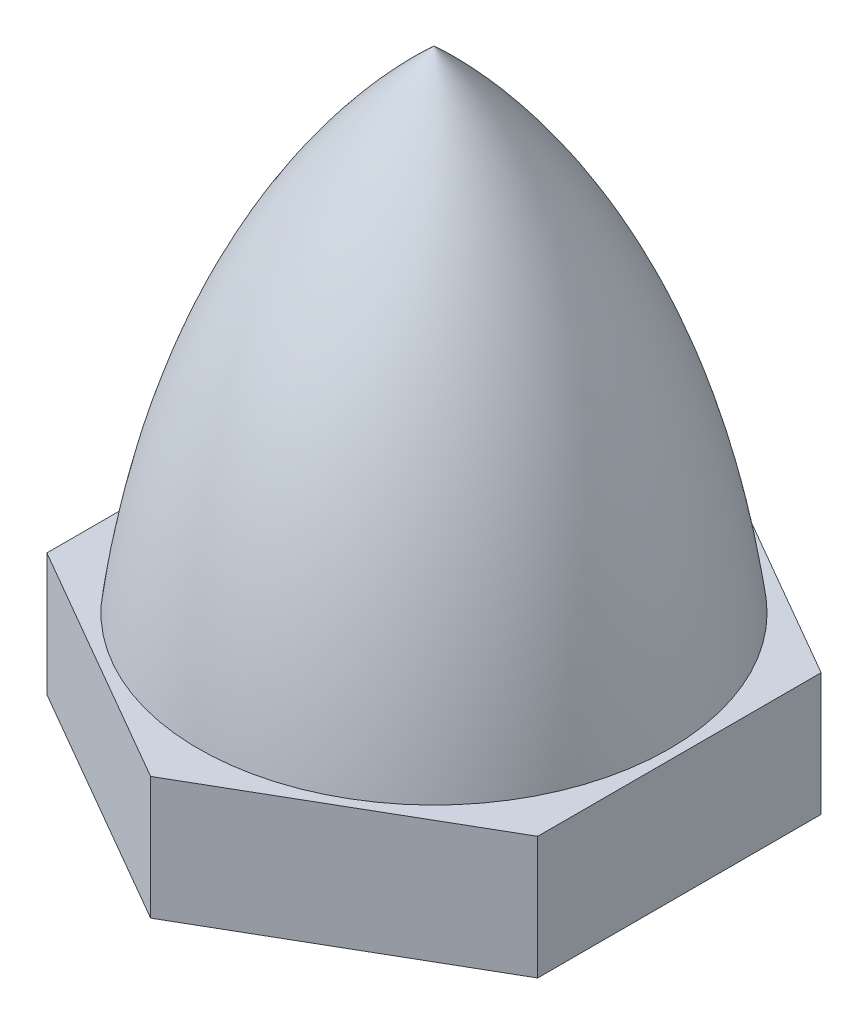
ISO-10303-21;
HEADER;
FILE_DESCRIPTION(('STEP AP214'),'2;1');
FILE_NAME('part.step','',(''),(''),'','','');
FILE_SCHEMA(('AUTOMOTIVE_DESIGN { 1 0 10303 214 1 1 1 1 }'));
ENDSEC;
DATA;
#1=APPLICATION_CONTEXT('core data for automotive mechanical design processes');
#2=APPLICATION_PROTOCOL_DEFINITION('international standard','automotive_design',2000,#1);
#3=PRODUCT_CONTEXT('',#1,'mechanical');
#4=PRODUCT('Part','Part','',(#3));
#5=PRODUCT_RELATED_PRODUCT_CATEGORY('part','',(#4));
#6=PRODUCT_DEFINITION_FORMATION('','',#4);
#7=PRODUCT_DEFINITION_CONTEXT('part definition',#1,'design');
#8=PRODUCT_DEFINITION('design','',#6,#7);
#9=PRODUCT_DEFINITION_SHAPE('','',#8);
#10=(LENGTH_UNIT() NAMED_UNIT(*) SI_UNIT(.MILLI.,.METRE.));
#11=(NAMED_UNIT(*) PLANE_ANGLE_UNIT() SI_UNIT($,.RADIAN.));
#12=(NAMED_UNIT(*) SI_UNIT($,.STERADIAN.) SOLID_ANGLE_UNIT());
#13=UNCERTAINTY_MEASURE_WITH_UNIT(LENGTH_MEASURE(1.E-05),#10,'distance_accuracy_value','');
#14=(GEOMETRIC_REPRESENTATION_CONTEXT(3) GLOBAL_UNCERTAINTY_ASSIGNED_CONTEXT((#13)) GLOBAL_UNIT_ASSIGNED_CONTEXT((#10,
#11,#12)) REPRESENTATION_CONTEXT('',''));
#15=CARTESIAN_POINT('',(0.,0.,0.));
#16=DIRECTION('',(0.,0.,1.));
#17=DIRECTION('',(1.,0.,0.));
#18=AXIS2_PLACEMENT_3D('',#15,#16,#17);
#19=CARTESIAN_POINT('',(6.,0.,0.));
#20=CARTESIAN_POINT('',(5.66302818861663,9.79483030371763,0.));
#21=CARTESIAN_POINT('',(0.,15.,0.));
#22=B_SPLINE_CURVE_WITH_KNOTS('',2,(#19,#20,#21),.UNSPECIFIED.,.F.,.F.,(3,3),(0.,1.),.UNSPECIFIED.);
#23=CARTESIAN_POINT('',(0.,0.,0.));
#24=DIRECTION('',(0.,-1.,0.));
#25=AXIS1_PLACEMENT('',#23,#24);
#26=SURFACE_OF_REVOLUTION('',#22,#25);
#27=CARTESIAN_POINT('',(0.,15.,0.));
#28=VERTEX_POINT('',#27);
#29=VERTEX_LOOP('',#28);
#30=FACE_BOUND('',#29,.T.);
#31=CARTESIAN_POINT('',(0.,3.,0.));
#32=DIRECTION('',(0.,-1.,0.));
#33=DIRECTION('',(0.,0.,-1.));
#34=AXIS2_PLACEMENT_3D('',#31,#32,#33);
#35=CIRCLE('',#34,5.75802837757463);
#36=CARTESIAN_POINT('',(0.,3.,-5.75802837757463));
#37=VERTEX_POINT('',#36);
#38=EDGE_CURVE('E11',#37,#37,#35,.F.);
#39=ORIENTED_EDGE('',*,*,#38,.T.);
#40=EDGE_LOOP('',(#39));
#41=FACE_BOUND('',#40,.T.);
#42=ADVANCED_FACE('F36',(#30,#41),#26,.F.);
#43=CARTESIAN_POINT('',(5.99999999999999,3.,3.46410161513776));
#44=DIRECTION('',(0.5,0.,0.866025403784439));
#45=DIRECTION('',(0.866025403784439,0.,-0.5));
#46=AXIS2_PLACEMENT_3D('',#43,#44,#45);
#47=PLANE('',#46);
#48=DIRECTION('',(-0.866025403784439,0.,0.5));
#49=VECTOR('',#48,1.);
#50=CARTESIAN_POINT('',(5.99999999999999,0.,3.46410161513776));
#51=LINE('',#50,#49);
#52=CARTESIAN_POINT('',(5.99999999999999,0.,3.46410161513776));
#53=VERTEX_POINT('',#52);
#54=CARTESIAN_POINT('',(0.,0.,6.92820323027551));
#55=VERTEX_POINT('',#54);
#56=EDGE_CURVE('E130',#53,#55,#51,.T.);
#57=ORIENTED_EDGE('',*,*,#56,.F.);
#58=DIRECTION('',(0.,-1.,0.));
#59=VECTOR('',#58,1.);
#60=CARTESIAN_POINT('',(5.99999999999999,3.,3.46410161513776));
#61=LINE('',#60,#59);
#62=CARTESIAN_POINT('',(5.99999999999999,3.,3.46410161513776));
#63=VERTEX_POINT('',#62);
#64=EDGE_CURVE('E44',#63,#53,#61,.T.);
#65=ORIENTED_EDGE('',*,*,#64,.F.);
#66=DIRECTION('',(-0.866025403784439,0.,0.5));
#67=VECTOR('',#66,1.);
#68=CARTESIAN_POINT('',(5.99999999999999,3.,3.46410161513776));
#69=LINE('',#68,#67);
#70=CARTESIAN_POINT('',(0.,3.,6.92820323027551));
#71=VERTEX_POINT('',#70);
#72=EDGE_CURVE('E143',#63,#71,#69,.T.);
#73=ORIENTED_EDGE('',*,*,#72,.T.);
#74=DIRECTION('',(0.,-1.,0.));
#75=VECTOR('',#74,1.);
#76=CARTESIAN_POINT('',(0.,3.,6.92820323027551));
#77=LINE('',#76,#75);
#78=EDGE_CURVE('E88',#71,#55,#77,.T.);
#79=ORIENTED_EDGE('',*,*,#78,.T.);
#80=EDGE_LOOP('',(#57,#65,#73,#79));
#81=FACE_BOUND('',#80,.T.);
#82=ADVANCED_FACE('F158',(#81),#47,.T.);
#83=CARTESIAN_POINT('',(5.99999999999999,3.,-3.46410161513776));
#84=DIRECTION('',(1.,0.,0.));
#85=DIRECTION('',(0.,0.,-1.));
#86=AXIS2_PLACEMENT_3D('',#83,#84,#85);
#87=PLANE('',#86);
#88=DIRECTION('',(0.,0.,1.));
#89=VECTOR('',#88,1.);
#90=CARTESIAN_POINT('',(5.99999999999999,0.,-3.46410161513776));
#91=LINE('',#90,#89);
#92=CARTESIAN_POINT('',(5.99999999999999,0.,-3.46410161513776));
#93=VERTEX_POINT('',#92);
#94=EDGE_CURVE('E81',#93,#53,#91,.T.);
#95=ORIENTED_EDGE('',*,*,#94,.F.);
#96=DIRECTION('',(0.,-1.,0.));
#97=VECTOR('',#96,1.);
#98=CARTESIAN_POINT('',(5.99999999999999,3.,-3.46410161513776));
#99=LINE('',#98,#97);
#100=CARTESIAN_POINT('',(5.99999999999999,3.,-3.46410161513776));
#101=VERTEX_POINT('',#100);
#102=EDGE_CURVE('E109',#101,#93,#99,.T.);
#103=ORIENTED_EDGE('',*,*,#102,.F.);
#104=DIRECTION('',(0.,0.,1.));
#105=VECTOR('',#104,1.);
#106=CARTESIAN_POINT('',(5.99999999999999,3.,-3.46410161513776));
#107=LINE('',#106,#105);
#108=EDGE_CURVE('E119',#101,#63,#107,.T.);
#109=ORIENTED_EDGE('',*,*,#108,.T.);
#110=ORIENTED_EDGE('',*,*,#64,.T.);
#111=EDGE_LOOP('',(#95,#103,#109,#110));
#112=FACE_BOUND('',#111,.T.);
#113=ADVANCED_FACE('F161',(#112),#87,.T.);
#114=CARTESIAN_POINT('',(0.,3.,-6.92820323027551));
#115=DIRECTION('',(0.5,0.,-0.866025403784439));
#116=DIRECTION('',(-0.866025403784439,0.,-0.5));
#117=AXIS2_PLACEMENT_3D('',#114,#115,#116);
#118=PLANE('',#117);
#119=DIRECTION('',(0.866025403784439,0.,0.5));
#120=VECTOR('',#119,1.);
#121=CARTESIAN_POINT('',(0.,0.,-6.92820323027551));
#122=LINE('',#121,#120);
#123=CARTESIAN_POINT('',(0.,0.,-6.92820323027551));
#124=VERTEX_POINT('',#123);
#125=EDGE_CURVE('E105',#124,#93,#122,.T.);
#126=ORIENTED_EDGE('',*,*,#125,.F.);
#127=DIRECTION('',(0.,-1.,0.));
#128=VECTOR('',#127,1.);
#129=CARTESIAN_POINT('',(0.,3.,-6.92820323027551));
#130=LINE('',#129,#128);
#131=CARTESIAN_POINT('',(0.,3.,-6.92820323027551));
#132=VERTEX_POINT('',#131);
#133=EDGE_CURVE('E99',#132,#124,#130,.T.);
#134=ORIENTED_EDGE('',*,*,#133,.F.);
#135=DIRECTION('',(0.866025403784439,0.,0.5));
#136=VECTOR('',#135,1.);
#137=CARTESIAN_POINT('',(0.,3.,-6.92820323027551));
#138=LINE('',#137,#136);
#139=EDGE_CURVE('E103',#132,#101,#138,.T.);
#140=ORIENTED_EDGE('',*,*,#139,.T.);
#141=ORIENTED_EDGE('',*,*,#102,.T.);
#142=EDGE_LOOP('',(#126,#134,#140,#141));
#143=FACE_BOUND('',#142,.T.);
#144=ADVANCED_FACE('F101',(#143),#118,.T.);
#145=CARTESIAN_POINT('',(-6.,3.,-3.46410161513776));
#146=DIRECTION('',(-0.5,0.,-0.866025403784439));
#147=DIRECTION('',(-0.866025403784439,0.,0.5));
#148=AXIS2_PLACEMENT_3D('',#145,#146,#147);
#149=PLANE('',#148);
#150=DIRECTION('',(0.866025403784439,0.,-0.5));
#151=VECTOR('',#150,1.);
#152=CARTESIAN_POINT('',(-6.,0.,-3.46410161513776));
#153=LINE('',#152,#151);
#154=CARTESIAN_POINT('',(-6.,0.,-3.46410161513776));
#155=VERTEX_POINT('',#154);
#156=EDGE_CURVE('E139',#155,#124,#153,.T.);
#157=ORIENTED_EDGE('',*,*,#156,.F.);
#158=DIRECTION('',(0.,-1.,0.));
#159=VECTOR('',#158,1.);
#160=CARTESIAN_POINT('',(-6.,3.,-3.46410161513776));
#161=LINE('',#160,#159);
#162=CARTESIAN_POINT('',(-6.,3.,-3.46410161513776));
#163=VERTEX_POINT('',#162);
#164=EDGE_CURVE('E110',#163,#155,#161,.T.);
#165=ORIENTED_EDGE('',*,*,#164,.F.);
#166=DIRECTION('',(0.866025403784439,0.,-0.5));
#167=VECTOR('',#166,1.);
#168=CARTESIAN_POINT('',(-6.,3.,-3.46410161513776));
#169=LINE('',#168,#167);
#170=EDGE_CURVE('E116',#163,#132,#169,.T.);
#171=ORIENTED_EDGE('',*,*,#170,.T.);
#172=ORIENTED_EDGE('',*,*,#133,.T.);
#173=EDGE_LOOP('',(#157,#165,#171,#172));
#174=FACE_BOUND('',#173,.T.);
#175=ADVANCED_FACE('F121',(#174),#149,.T.);
#176=CARTESIAN_POINT('',(-6.,3.,3.46410161513776));
#177=DIRECTION('',(-1.,0.,0.));
#178=DIRECTION('',(0.,0.,1.));
#179=AXIS2_PLACEMENT_3D('',#176,#177,#178);
#180=PLANE('',#179);
#181=DIRECTION('',(0.,0.,-1.));
#182=VECTOR('',#181,1.);
#183=CARTESIAN_POINT('',(-6.,0.,3.46410161513776));
#184=LINE('',#183,#182);
#185=CARTESIAN_POINT('',(-6.,0.,3.46410161513776));
#186=VERTEX_POINT('',#185);
#187=EDGE_CURVE('E136',#186,#155,#184,.T.);
#188=ORIENTED_EDGE('',*,*,#187,.F.);
#189=DIRECTION('',(0.,-1.,0.));
#190=VECTOR('',#189,1.);
#191=CARTESIAN_POINT('',(-6.,3.,3.46410161513776));
#192=LINE('',#191,#190);
#193=CARTESIAN_POINT('',(-6.,3.,3.46410161513776));
#194=VERTEX_POINT('',#193);
#195=EDGE_CURVE('E147',#194,#186,#192,.T.);
#196=ORIENTED_EDGE('',*,*,#195,.F.);
#197=DIRECTION('',(0.,0.,-1.));
#198=VECTOR('',#197,1.);
#199=CARTESIAN_POINT('',(-6.,3.,3.46410161513776));
#200=LINE('',#199,#198);
#201=EDGE_CURVE('E123',#194,#163,#200,.T.);
#202=ORIENTED_EDGE('',*,*,#201,.T.);
#203=ORIENTED_EDGE('',*,*,#164,.T.);
#204=EDGE_LOOP('',(#188,#196,#202,#203));
#205=FACE_BOUND('',#204,.T.);
#206=ADVANCED_FACE('F165',(#205),#180,.T.);
#207=CARTESIAN_POINT('',(0.,3.,6.92820323027551));
#208=DIRECTION('',(-0.5,0.,0.866025403784438));
#209=DIRECTION('',(0.866025403784439,0.,0.5));
#210=AXIS2_PLACEMENT_3D('',#207,#208,#209);
#211=PLANE('',#210);
#212=DIRECTION('',(-0.866025403784438,0.,-0.5));
#213=VECTOR('',#212,1.);
#214=CARTESIAN_POINT('',(0.,0.,6.92820323027551));
#215=LINE('',#214,#213);
#216=EDGE_CURVE('E132',#55,#186,#215,.T.);
#217=ORIENTED_EDGE('',*,*,#216,.F.);
#218=ORIENTED_EDGE('',*,*,#78,.F.);
#219=DIRECTION('',(-0.866025403784438,0.,-0.5));
#220=VECTOR('',#219,1.);
#221=CARTESIAN_POINT('',(0.,3.,6.92820323027551));
#222=LINE('',#221,#220);
#223=EDGE_CURVE('E125',#71,#194,#222,.T.);
#224=ORIENTED_EDGE('',*,*,#223,.T.);
#225=ORIENTED_EDGE('',*,*,#195,.T.);
#226=EDGE_LOOP('',(#217,#218,#224,#225));
#227=FACE_BOUND('',#226,.T.);
#228=ADVANCED_FACE('F162',(#227),#211,.T.);
#229=CARTESIAN_POINT('',(0.,3.,0.));
#230=DIRECTION('',(0.,-1.,0.));
#231=DIRECTION('',(0.,0.,-1.));
#232=AXIS2_PLACEMENT_3D('',#229,#230,#231);
#233=PLANE('',#232);
#234=ORIENTED_EDGE('',*,*,#38,.F.);
#235=EDGE_LOOP('',(#234));
#236=FACE_BOUND('',#235,.T.);
#237=ORIENTED_EDGE('',*,*,#72,.F.);
#238=ORIENTED_EDGE('',*,*,#108,.F.);
#239=ORIENTED_EDGE('',*,*,#139,.F.);
#240=ORIENTED_EDGE('',*,*,#170,.F.);
#241=ORIENTED_EDGE('',*,*,#201,.F.);
#242=ORIENTED_EDGE('',*,*,#223,.F.);
#243=EDGE_LOOP('',(#237,#238,#239,#240,#241,#242));
#244=FACE_BOUND('',#243,.T.);
#245=ADVANCED_FACE('F114',(#236,#244),#233,.F.);
#246=CARTESIAN_POINT('',(0.,0.,0.));
#247=DIRECTION('',(0.,-1.,0.));
#248=DIRECTION('',(0.,0.,-1.));
#249=AXIS2_PLACEMENT_3D('',#246,#247,#248);
#250=PLANE('',#249);
#251=CARTESIAN_POINT('',(0.,0.,0.));
#252=DIRECTION('',(0.,-1.,0.));
#253=DIRECTION('',(0.,0.,-1.));
#254=AXIS2_PLACEMENT_3D('',#251,#252,#253);
#255=CIRCLE('',#254,2.5);
#256=CARTESIAN_POINT('',(0.,0.,-2.5));
#257=VERTEX_POINT('',#256);
#258=EDGE_CURVE('E193',#257,#257,#255,.T.);
#259=ORIENTED_EDGE('',*,*,#258,.F.);
#260=EDGE_LOOP('',(#259));
#261=FACE_BOUND('',#260,.T.);
#262=ORIENTED_EDGE('',*,*,#156,.T.);
#263=ORIENTED_EDGE('',*,*,#125,.T.);
#264=ORIENTED_EDGE('',*,*,#94,.T.);
#265=ORIENTED_EDGE('',*,*,#56,.T.);
#266=ORIENTED_EDGE('',*,*,#216,.T.);
#267=ORIENTED_EDGE('',*,*,#187,.T.);
#268=EDGE_LOOP('',(#262,#263,#264,#265,#266,#267));
#269=FACE_BOUND('',#268,.T.);
#270=ADVANCED_FACE('F38',(#261,#269),#250,.T.);
#271=CARTESIAN_POINT('',(0.,9.,0.));
#272=DIRECTION('',(0.,1.,0.));
#273=DIRECTION('',(0.,0.,1.));
#274=AXIS2_PLACEMENT_3D('',#271,#272,#273);
#275=PLANE('',#274);
#276=CARTESIAN_POINT('',(0.,9.,0.));
#277=DIRECTION('',(0.,-1.,0.));
#278=DIRECTION('',(0.,0.,-1.));
#279=AXIS2_PLACEMENT_3D('',#276,#277,#278);
#280=CIRCLE('',#279,2.5);
#281=CARTESIAN_POINT('',(0.,9.,-2.5));
#282=VERTEX_POINT('',#281);
#283=EDGE_CURVE('E133',#282,#282,#280,.T.);
#284=ORIENTED_EDGE('',*,*,#283,.T.);
#285=EDGE_LOOP('',(#284));
#286=FACE_BOUND('',#285,.T.);
#287=ADVANCED_FACE('F179',(#286),#275,.F.);
#288=CARTESIAN_POINT('',(0.,0.,0.));
#289=DIRECTION('',(0.,-1.,0.));
#290=DIRECTION('',(0.,0.,-1.));
#291=AXIS2_PLACEMENT_3D('',#288,#289,#290);
#292=CYLINDRICAL_SURFACE('',#291,2.5);
#293=ORIENTED_EDGE('',*,*,#283,.F.);
#294=EDGE_LOOP('',(#293));
#295=FACE_BOUND('',#294,.T.);
#296=ORIENTED_EDGE('',*,*,#258,.T.);
#297=EDGE_LOOP('',(#296));
#298=FACE_BOUND('',#297,.T.);
#299=ADVANCED_FACE('F182',(#295,#298),#292,.F.);
#300=CLOSED_SHELL('',(#42,#82,#113,#144,#175,#206,#228,#245,#270,#287,#299));
#301=MANIFOLD_SOLID_BREP('B2',#300);
#302=ADVANCED_BREP_SHAPE_REPRESENTATION('',(#18,#301),#14);
#303=SHAPE_DEFINITION_REPRESENTATION(#9,#302);
ENDSEC;
END-ISO-10303-21;
